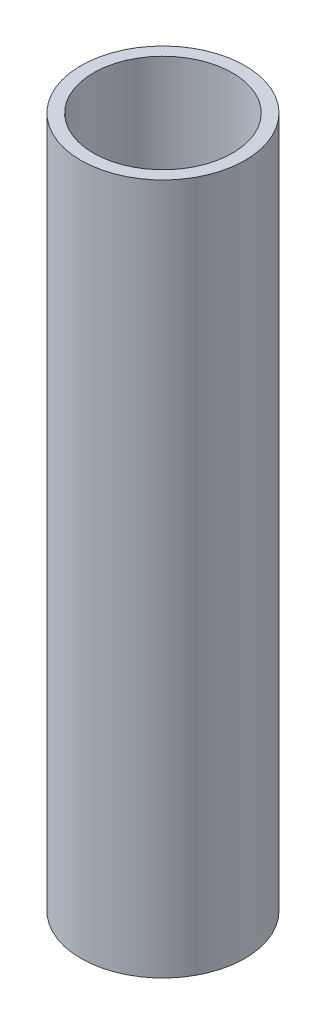
ISO-10303-21;
HEADER;
FILE_DESCRIPTION(('STEP AP214'),'2;1');
FILE_NAME('part.step','',(''),(''),'','','');
FILE_SCHEMA(('AUTOMOTIVE_DESIGN { 1 0 10303 214 1 1 1 1 }'));
ENDSEC;
DATA;
#1=APPLICATION_CONTEXT('core data for automotive mechanical design processes');
#2=APPLICATION_PROTOCOL_DEFINITION('international standard','automotive_design',2000,#1);
#3=PRODUCT_CONTEXT('',#1,'mechanical');
#4=PRODUCT('Part','Part','',(#3));
#5=PRODUCT_RELATED_PRODUCT_CATEGORY('part','',(#4));
#6=PRODUCT_DEFINITION_FORMATION('','',#4);
#7=PRODUCT_DEFINITION_CONTEXT('part definition',#1,'design');
#8=PRODUCT_DEFINITION('design','',#6,#7);
#9=PRODUCT_DEFINITION_SHAPE('','',#8);
#10=(LENGTH_UNIT() NAMED_UNIT(*) SI_UNIT(.MILLI.,.METRE.));
#11=(NAMED_UNIT(*) PLANE_ANGLE_UNIT() SI_UNIT($,.RADIAN.));
#12=(NAMED_UNIT(*) SI_UNIT($,.STERADIAN.) SOLID_ANGLE_UNIT());
#13=UNCERTAINTY_MEASURE_WITH_UNIT(LENGTH_MEASURE(1.E-05),#10,'distance_accuracy_value','');
#14=(GEOMETRIC_REPRESENTATION_CONTEXT(3) GLOBAL_UNCERTAINTY_ASSIGNED_CONTEXT((#13)) GLOBAL_UNIT_ASSIGNED_CONTEXT((#10,
#11,#12)) REPRESENTATION_CONTEXT('',''));
#15=CARTESIAN_POINT('',(0.,0.,0.));
#16=DIRECTION('',(0.,0.,1.));
#17=DIRECTION('',(1.,0.,0.));
#18=AXIS2_PLACEMENT_3D('',#15,#16,#17);
#19=CARTESIAN_POINT('',(0.,0.,0.));
#20=DIRECTION('',(0.,1.,0.));
#21=DIRECTION('',(0.,0.,1.));
#22=AXIS2_PLACEMENT_3D('',#19,#20,#21);
#23=CYLINDRICAL_SURFACE('',#22,20.447);
#24=CARTESIAN_POINT('',(0.,203.2,0.));
#25=DIRECTION('',(0.,1.,0.));
#26=DIRECTION('',(0.,0.,1.));
#27=AXIS2_PLACEMENT_3D('',#24,#25,#26);
#28=CIRCLE('',#27,20.447);
#29=CARTESIAN_POINT('',(0.,203.2,20.447));
#30=VERTEX_POINT('',#29);
#31=EDGE_CURVE('E18',#30,#30,#28,.F.);
#32=ORIENTED_EDGE('',*,*,#31,.F.);
#33=EDGE_LOOP('',(#32));
#34=FACE_BOUND('',#33,.T.);
#35=CARTESIAN_POINT('',(0.,0.,0.));
#36=DIRECTION('',(0.,1.,0.));
#37=DIRECTION('',(0.,0.,1.));
#38=AXIS2_PLACEMENT_3D('',#35,#36,#37);
#39=CIRCLE('',#38,20.447);
#40=CARTESIAN_POINT('',(0.,0.,20.447));
#41=VERTEX_POINT('',#40);
#42=EDGE_CURVE('E27',#41,#41,#39,.F.);
#43=ORIENTED_EDGE('',*,*,#42,.T.);
#44=EDGE_LOOP('',(#43));
#45=FACE_BOUND('',#44,.T.);
#46=ADVANCED_FACE('F15',(#34,#45),#23,.F.);
#47=CARTESIAN_POINT('',(0.,203.2,0.));
#48=DIRECTION('',(0.,1.,0.));
#49=DIRECTION('',(0.,0.,1.));
#50=AXIS2_PLACEMENT_3D('',#47,#48,#49);
#51=PLANE('',#50);
#52=ORIENTED_EDGE('',*,*,#31,.T.);
#53=EDGE_LOOP('',(#52));
#54=FACE_BOUND('',#53,.T.);
#55=CARTESIAN_POINT('',(0.,203.2,0.));
#56=DIRECTION('',(0.,1.,0.));
#57=DIRECTION('',(0.,0.,1.));
#58=AXIS2_PLACEMENT_3D('',#55,#56,#57);
#59=CIRCLE('',#58,24.13);
#60=CARTESIAN_POINT('',(0.,203.2,24.13));
#61=VERTEX_POINT('',#60);
#62=EDGE_CURVE('E22',#61,#61,#59,.F.);
#63=ORIENTED_EDGE('',*,*,#62,.F.);
#64=EDGE_LOOP('',(#63));
#65=FACE_BOUND('',#64,.T.);
#66=ADVANCED_FACE('F35',(#54,#65),#51,.T.);
#67=CARTESIAN_POINT('',(0.,0.,0.));
#68=DIRECTION('',(0.,1.,0.));
#69=DIRECTION('',(0.,0.,1.));
#70=AXIS2_PLACEMENT_3D('',#67,#68,#69);
#71=PLANE('',#70);
#72=ORIENTED_EDGE('',*,*,#42,.F.);
#73=EDGE_LOOP('',(#72));
#74=FACE_BOUND('',#73,.T.);
#75=CARTESIAN_POINT('',(0.,0.,0.));
#76=DIRECTION('',(0.,1.,0.));
#77=DIRECTION('',(0.,0.,1.));
#78=AXIS2_PLACEMENT_3D('',#75,#76,#77);
#79=CIRCLE('',#78,24.13);
#80=CARTESIAN_POINT('',(0.,0.,24.13));
#81=VERTEX_POINT('',#80);
#82=EDGE_CURVE('E10',#81,#81,#79,.T.);
#83=ORIENTED_EDGE('',*,*,#82,.F.);
#84=EDGE_LOOP('',(#83));
#85=FACE_BOUND('',#84,.T.);
#86=ADVANCED_FACE('F43',(#74,#85),#71,.F.);
#87=CARTESIAN_POINT('',(0.,0.,0.));
#88=DIRECTION('',(0.,1.,0.));
#89=DIRECTION('',(0.,0.,1.));
#90=AXIS2_PLACEMENT_3D('',#87,#88,#89);
#91=CYLINDRICAL_SURFACE('',#90,24.13);
#92=ORIENTED_EDGE('',*,*,#62,.T.);
#93=EDGE_LOOP('',(#92));
#94=FACE_BOUND('',#93,.T.);
#95=ORIENTED_EDGE('',*,*,#82,.T.);
#96=EDGE_LOOP('',(#95));
#97=FACE_BOUND('',#96,.T.);
#98=ADVANCED_FACE('F44',(#94,#97),#91,.T.);
#99=CLOSED_SHELL('',(#46,#66,#86,#98));
#100=MANIFOLD_SOLID_BREP('B1',#99);
#101=ADVANCED_BREP_SHAPE_REPRESENTATION('',(#18,#100),#14);
#102=SHAPE_DEFINITION_REPRESENTATION(#9,#101);
ENDSEC;
END-ISO-10303-21;
